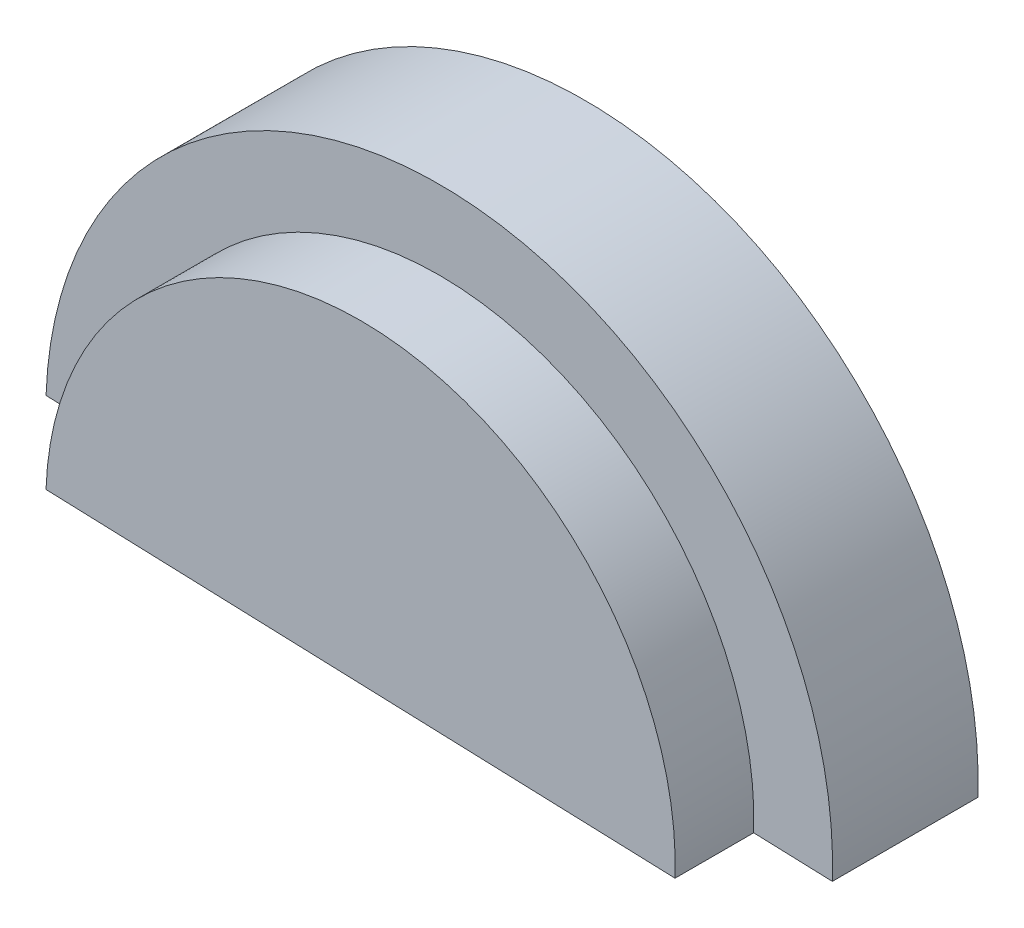
ISO-10303-21;
HEADER;
FILE_DESCRIPTION(('STEP AP214'),'2;1');
FILE_NAME('part.step','',(''),(''),'','','');
FILE_SCHEMA(('AUTOMOTIVE_DESIGN { 1 0 10303 214 1 1 1 1 }'));
ENDSEC;
DATA;
#1=APPLICATION_CONTEXT('core data for automotive mechanical design processes');
#2=APPLICATION_PROTOCOL_DEFINITION('international standard','automotive_design',2000,#1);
#3=PRODUCT_CONTEXT('',#1,'mechanical');
#4=PRODUCT('Part','Part','',(#3));
#5=PRODUCT_RELATED_PRODUCT_CATEGORY('part','',(#4));
#6=PRODUCT_DEFINITION_FORMATION('','',#4);
#7=PRODUCT_DEFINITION_CONTEXT('part definition',#1,'design');
#8=PRODUCT_DEFINITION('design','',#6,#7);
#9=PRODUCT_DEFINITION_SHAPE('','',#8);
#10=(LENGTH_UNIT() NAMED_UNIT(*) SI_UNIT(.MILLI.,.METRE.));
#11=(NAMED_UNIT(*) PLANE_ANGLE_UNIT() SI_UNIT($,.RADIAN.));
#12=(NAMED_UNIT(*) SI_UNIT($,.STERADIAN.) SOLID_ANGLE_UNIT());
#13=UNCERTAINTY_MEASURE_WITH_UNIT(LENGTH_MEASURE(1.E-05),#10,'distance_accuracy_value','');
#14=(GEOMETRIC_REPRESENTATION_CONTEXT(3) GLOBAL_UNCERTAINTY_ASSIGNED_CONTEXT((#13)) GLOBAL_UNIT_ASSIGNED_CONTEXT((#10,
#11,#12)) REPRESENTATION_CONTEXT('',''));
#15=CARTESIAN_POINT('',(0.,0.,0.));
#16=DIRECTION('',(0.,0.,1.));
#17=DIRECTION('',(1.,0.,0.));
#18=AXIS2_PLACEMENT_3D('',#15,#16,#17);
#19=CARTESIAN_POINT('',(499.690187370493,-17.5987682989868,185.));
#20=DIRECTION('',(0.,0.,-1.));
#21=DIRECTION('',(-1.,0.,0.));
#22=AXIS2_PLACEMENT_3D('',#19,#20,#21);
#23=PLANE('',#22);
#24=CARTESIAN_POINT('',(499.690187370493,-17.5987682989866,185.));
#25=DIRECTION('',(0.,0.,1.));
#26=DIRECTION('',(-1.,0.,0.));
#27=AXIS2_PLACEMENT_3D('',#24,#25,#26);
#28=CIRCLE('',#27,400.);
#29=CARTESIAN_POINT('',(899.442337266888,-31.6777829381759,185.));
#30=VERTEX_POINT('',#29);
#31=CARTESIAN_POINT('',(99.9380374740987,-3.51975365979732,185.));
#32=VERTEX_POINT('',#31);
#33=EDGE_CURVE('E48',#30,#32,#28,.T.);
#34=ORIENTED_EDGE('',*,*,#33,.F.);
#35=DIRECTION('',(0.999380374740987,-0.0351975365979732,0.));
#36=VECTOR('',#35,1.);
#37=CARTESIAN_POINT('',(0.,0.,185.));
#38=LINE('',#37,#36);
#39=CARTESIAN_POINT('',(999.380374740987,-35.1975365979732,185.));
#40=VERTEX_POINT('',#39);
#41=EDGE_CURVE('E53',#30,#40,#38,.T.);
#42=ORIENTED_EDGE('',*,*,#41,.T.);
#43=CARTESIAN_POINT('',(499.690187370493,-17.5987682989868,185.));
#44=DIRECTION('',(0.,0.,1.));
#45=DIRECTION('',(-1.,0.,0.));
#46=AXIS2_PLACEMENT_3D('',#43,#44,#45);
#47=CIRCLE('',#46,500.);
#48=CARTESIAN_POINT('',(0.,0.,185.));
#49=VERTEX_POINT('',#48);
#50=EDGE_CURVE('E73',#40,#49,#47,.T.);
#51=ORIENTED_EDGE('',*,*,#50,.T.);
#52=EDGE_CURVE('E77',#49,#32,#38,.T.);
#53=ORIENTED_EDGE('',*,*,#52,.T.);
#54=EDGE_LOOP('',(#34,#42,#51,#53));
#55=FACE_BOUND('',#54,.T.);
#56=ADVANCED_FACE('F31',(#55),#23,.F.);
#57=CARTESIAN_POINT('',(499.690187370493,-17.5987682989868,185.));
#58=DIRECTION('',(0.,0.,-1.));
#59=DIRECTION('',(-1.,0.,0.));
#60=AXIS2_PLACEMENT_3D('',#57,#58,#59);
#61=CYLINDRICAL_SURFACE('',#60,500.);
#62=CARTESIAN_POINT('',(499.690187370493,-17.5987682989868,0.));
#63=DIRECTION('',(0.,0.,1.));
#64=DIRECTION('',(-1.,0.,0.));
#65=AXIS2_PLACEMENT_3D('',#62,#63,#64);
#66=CIRCLE('',#65,500.);
#67=CARTESIAN_POINT('',(999.380374740987,-35.1975365979732,0.));
#68=VERTEX_POINT('',#67);
#69=CARTESIAN_POINT('',(0.,0.,0.));
#70=VERTEX_POINT('',#69);
#71=EDGE_CURVE('E74',#68,#70,#66,.T.);
#72=ORIENTED_EDGE('',*,*,#71,.T.);
#73=DIRECTION('',(0.,0.,-1.));
#74=VECTOR('',#73,1.);
#75=CARTESIAN_POINT('',(0.,0.,185.));
#76=LINE('',#75,#74);
#77=EDGE_CURVE('E11',#49,#70,#76,.T.);
#78=ORIENTED_EDGE('',*,*,#77,.F.);
#79=ORIENTED_EDGE('',*,*,#50,.F.);
#80=DIRECTION('',(0.,0.,-1.));
#81=VECTOR('',#80,1.);
#82=CARTESIAN_POINT('',(999.380374740987,-35.1975365979732,185.));
#83=LINE('',#82,#81);
#84=EDGE_CURVE('E40',#40,#68,#83,.T.);
#85=ORIENTED_EDGE('',*,*,#84,.T.);
#86=EDGE_LOOP('',(#72,#78,#79,#85));
#87=FACE_BOUND('',#86,.T.);
#88=ADVANCED_FACE('F33',(#87),#61,.T.);
#89=CARTESIAN_POINT('',(0.,0.,185.));
#90=DIRECTION('',(0.0351975365979732,0.999380374740986,0.));
#91=DIRECTION('',(-0.999380374740987,0.0351975365979732,0.));
#92=AXIS2_PLACEMENT_3D('',#89,#90,#91);
#93=PLANE('',#92);
#94=DIRECTION('',(0.999380374740987,-0.0351975365979732,0.));
#95=VECTOR('',#94,1.);
#96=CARTESIAN_POINT('',(0.,0.,0.));
#97=LINE('',#96,#95);
#98=EDGE_CURVE('E65',#70,#68,#97,.T.);
#99=ORIENTED_EDGE('',*,*,#98,.T.);
#100=ORIENTED_EDGE('',*,*,#84,.F.);
#101=ORIENTED_EDGE('',*,*,#41,.F.);
#102=DIRECTION('',(0.,0.,-1.));
#103=VECTOR('',#102,1.);
#104=CARTESIAN_POINT('',(899.442337266888,-31.6777829381758,285.));
#105=LINE('',#104,#103);
#106=CARTESIAN_POINT('',(899.442337266888,-31.6777829381758,285.));
#107=VERTEX_POINT('',#106);
#108=EDGE_CURVE('E83',#107,#30,#105,.T.);
#109=ORIENTED_EDGE('',*,*,#108,.F.);
#110=DIRECTION('',(0.999380374740986,-0.0351975365979732,0.));
#111=VECTOR('',#110,1.);
#112=CARTESIAN_POINT('',(99.9380374740987,-3.51975365979732,285.));
#113=LINE('',#112,#111);
#114=CARTESIAN_POINT('',(99.9380374740987,-3.51975365979732,285.));
#115=VERTEX_POINT('',#114);
#116=EDGE_CURVE('E97',#115,#107,#113,.T.);
#117=ORIENTED_EDGE('',*,*,#116,.F.);
#118=DIRECTION('',(0.,0.,-1.));
#119=VECTOR('',#118,1.);
#120=CARTESIAN_POINT('',(99.9380374740987,-3.51975365979732,285.));
#121=LINE('',#120,#119);
#122=EDGE_CURVE('E80',#115,#32,#121,.T.);
#123=ORIENTED_EDGE('',*,*,#122,.T.);
#124=ORIENTED_EDGE('',*,*,#52,.F.);
#125=ORIENTED_EDGE('',*,*,#77,.T.);
#126=EDGE_LOOP('',(#99,#100,#101,#109,#117,#123,#124,#125));
#127=FACE_BOUND('',#126,.T.);
#128=ADVANCED_FACE('F67',(#127),#93,.F.);
#129=CARTESIAN_POINT('',(499.690187370493,-17.5987682989868,0.));
#130=DIRECTION('',(0.,0.,-1.));
#131=DIRECTION('',(-1.,0.,0.));
#132=AXIS2_PLACEMENT_3D('',#129,#130,#131);
#133=PLANE('',#132);
#134=ORIENTED_EDGE('',*,*,#71,.F.);
#135=ORIENTED_EDGE('',*,*,#98,.F.);
#136=EDGE_LOOP('',(#134,#135));
#137=FACE_BOUND('',#136,.T.);
#138=ADVANCED_FACE('F79',(#137),#133,.T.);
#139=CARTESIAN_POINT('',(499.690187370493,-17.5987682989866,285.));
#140=DIRECTION('',(0.,0.,-1.));
#141=DIRECTION('',(-1.,0.,0.));
#142=AXIS2_PLACEMENT_3D('',#139,#140,#141);
#143=CYLINDRICAL_SURFACE('',#142,400.);
#144=ORIENTED_EDGE('',*,*,#33,.T.);
#145=ORIENTED_EDGE('',*,*,#122,.F.);
#146=CARTESIAN_POINT('',(499.690187370493,-17.5987682989866,285.));
#147=DIRECTION('',(0.,0.,1.));
#148=DIRECTION('',(-1.,0.,0.));
#149=AXIS2_PLACEMENT_3D('',#146,#147,#148);
#150=CIRCLE('',#149,400.);
#151=EDGE_CURVE('E94',#107,#115,#150,.T.);
#152=ORIENTED_EDGE('',*,*,#151,.F.);
#153=ORIENTED_EDGE('',*,*,#108,.T.);
#154=EDGE_LOOP('',(#144,#145,#152,#153));
#155=FACE_BOUND('',#154,.T.);
#156=ADVANCED_FACE('F109',(#155),#143,.T.);
#157=CARTESIAN_POINT('',(499.690187370493,-17.5987682989866,285.));
#158=DIRECTION('',(0.,0.,-1.));
#159=DIRECTION('',(-1.,0.,0.));
#160=AXIS2_PLACEMENT_3D('',#157,#158,#159);
#161=PLANE('',#160);
#162=ORIENTED_EDGE('',*,*,#151,.T.);
#163=ORIENTED_EDGE('',*,*,#116,.T.);
#164=EDGE_LOOP('',(#162,#163));
#165=FACE_BOUND('',#164,.T.);
#166=ADVANCED_FACE('F111',(#165),#161,.F.);
#167=CLOSED_SHELL('',(#56,#88,#128,#138,#156,#166));
#168=MANIFOLD_SOLID_BREP('B2',#167);
#169=ADVANCED_BREP_SHAPE_REPRESENTATION('',(#18,#168),#14);
#170=SHAPE_DEFINITION_REPRESENTATION(#9,#169);
ENDSEC;
END-ISO-10303-21;
